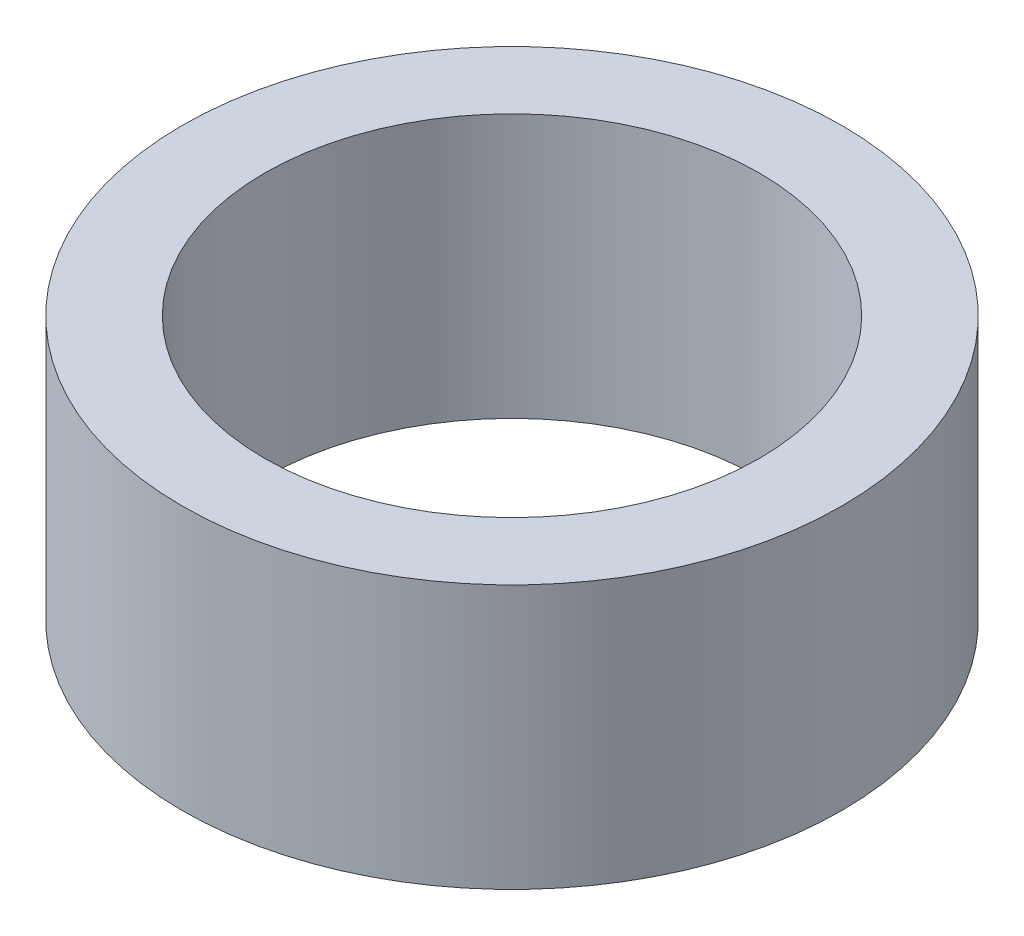
ISO-10303-21;
HEADER;
FILE_DESCRIPTION(('STEP AP214'),'2;1');
FILE_NAME('part.step','',(''),(''),'','','');
FILE_SCHEMA(('AUTOMOTIVE_DESIGN { 1 0 10303 214 1 1 1 1 }'));
ENDSEC;
DATA;
#1=APPLICATION_CONTEXT('core data for automotive mechanical design processes');
#2=APPLICATION_PROTOCOL_DEFINITION('international standard','automotive_design',2000,#1);
#3=PRODUCT_CONTEXT('',#1,'mechanical');
#4=PRODUCT('Part','Part','',(#3));
#5=PRODUCT_RELATED_PRODUCT_CATEGORY('part','',(#4));
#6=PRODUCT_DEFINITION_FORMATION('','',#4);
#7=PRODUCT_DEFINITION_CONTEXT('part definition',#1,'design');
#8=PRODUCT_DEFINITION('design','',#6,#7);
#9=PRODUCT_DEFINITION_SHAPE('','',#8);
#10=(LENGTH_UNIT() NAMED_UNIT(*) SI_UNIT(.MILLI.,.METRE.));
#11=(NAMED_UNIT(*) PLANE_ANGLE_UNIT() SI_UNIT($,.RADIAN.));
#12=(NAMED_UNIT(*) SI_UNIT($,.STERADIAN.) SOLID_ANGLE_UNIT());
#13=UNCERTAINTY_MEASURE_WITH_UNIT(LENGTH_MEASURE(1.E-05),#10,'distance_accuracy_value','');
#14=(GEOMETRIC_REPRESENTATION_CONTEXT(3) GLOBAL_UNCERTAINTY_ASSIGNED_CONTEXT((#13)) GLOBAL_UNIT_ASSIGNED_CONTEXT((#10,
#11,#12)) REPRESENTATION_CONTEXT('',''));
#15=CARTESIAN_POINT('',(0.,0.,0.));
#16=DIRECTION('',(0.,0.,1.));
#17=DIRECTION('',(1.,0.,0.));
#18=AXIS2_PLACEMENT_3D('',#15,#16,#17);
#19=CARTESIAN_POINT('',(0.,24.,0.));
#20=DIRECTION('',(0.,-1.,0.));
#21=DIRECTION('',(0.,0.,-1.));
#22=AXIS2_PLACEMENT_3D('',#19,#20,#21);
#23=CYLINDRICAL_SURFACE('',#22,30.);
#24=CARTESIAN_POINT('',(0.,24.,0.));
#25=DIRECTION('',(0.,1.,0.));
#26=DIRECTION('',(0.,0.,1.));
#27=AXIS2_PLACEMENT_3D('',#24,#25,#26);
#28=CIRCLE('',#27,30.);
#29=CARTESIAN_POINT('',(0.,24.,30.));
#30=VERTEX_POINT('',#29);
#31=EDGE_CURVE('E10',#30,#30,#28,.T.);
#32=ORIENTED_EDGE('',*,*,#31,.F.);
#33=EDGE_LOOP('',(#32));
#34=FACE_BOUND('',#33,.T.);
#35=CARTESIAN_POINT('',(0.,0.,0.));
#36=DIRECTION('',(0.,1.,0.));
#37=DIRECTION('',(0.,0.,1.));
#38=AXIS2_PLACEMENT_3D('',#35,#36,#37);
#39=CIRCLE('',#38,30.);
#40=CARTESIAN_POINT('',(0.,0.,30.));
#41=VERTEX_POINT('',#40);
#42=EDGE_CURVE('E37',#41,#41,#39,.T.);
#43=ORIENTED_EDGE('',*,*,#42,.T.);
#44=EDGE_LOOP('',(#43));
#45=FACE_BOUND('',#44,.T.);
#46=ADVANCED_FACE('F40',(#34,#45),#23,.T.);
#47=CARTESIAN_POINT('',(0.,24.,0.));
#48=DIRECTION('',(0.,1.,0.));
#49=DIRECTION('',(0.,0.,1.));
#50=AXIS2_PLACEMENT_3D('',#47,#48,#49);
#51=PLANE('',#50);
#52=CARTESIAN_POINT('',(0.,24.,0.));
#53=DIRECTION('',(0.,1.,0.));
#54=DIRECTION('',(0.,0.,1.));
#55=AXIS2_PLACEMENT_3D('',#52,#53,#54);
#56=CIRCLE('',#55,22.5);
#57=CARTESIAN_POINT('',(0.,24.,22.5));
#58=VERTEX_POINT('',#57);
#59=EDGE_CURVE('E50',#58,#58,#56,.T.);
#60=ORIENTED_EDGE('',*,*,#59,.F.);
#61=EDGE_LOOP('',(#60));
#62=FACE_BOUND('',#61,.T.);
#63=ORIENTED_EDGE('',*,*,#31,.T.);
#64=EDGE_LOOP('',(#63));
#65=FACE_BOUND('',#64,.T.);
#66=ADVANCED_FACE('F59',(#62,#65),#51,.T.);
#67=CARTESIAN_POINT('',(0.,0.,0.));
#68=DIRECTION('',(0.,1.,0.));
#69=DIRECTION('',(0.,0.,1.));
#70=AXIS2_PLACEMENT_3D('',#67,#68,#69);
#71=PLANE('',#70);
#72=CARTESIAN_POINT('',(0.,0.,0.));
#73=DIRECTION('',(0.,1.,0.));
#74=DIRECTION('',(0.,0.,1.));
#75=AXIS2_PLACEMENT_3D('',#72,#73,#74);
#76=CIRCLE('',#75,22.5);
#77=CARTESIAN_POINT('',(0.,0.,22.5));
#78=VERTEX_POINT('',#77);
#79=EDGE_CURVE('E47',#78,#78,#76,.T.);
#80=ORIENTED_EDGE('',*,*,#79,.T.);
#81=EDGE_LOOP('',(#80));
#82=FACE_BOUND('',#81,.T.);
#83=ORIENTED_EDGE('',*,*,#42,.F.);
#84=EDGE_LOOP('',(#83));
#85=FACE_BOUND('',#84,.T.);
#86=ADVANCED_FACE('F58',(#82,#85),#71,.F.);
#87=CARTESIAN_POINT('',(0.,24.,0.));
#88=DIRECTION('',(0.,-1.,0.));
#89=DIRECTION('',(0.,0.,-1.));
#90=AXIS2_PLACEMENT_3D('',#87,#88,#89);
#91=CYLINDRICAL_SURFACE('',#90,22.5);
#92=ORIENTED_EDGE('',*,*,#59,.T.);
#93=EDGE_LOOP('',(#92));
#94=FACE_BOUND('',#93,.T.);
#95=ORIENTED_EDGE('',*,*,#79,.F.);
#96=EDGE_LOOP('',(#95));
#97=FACE_BOUND('',#96,.T.);
#98=ADVANCED_FACE('F54',(#94,#97),#91,.F.);
#99=CLOSED_SHELL('',(#46,#66,#86,#98));
#100=MANIFOLD_SOLID_BREP('B2',#99);
#101=ADVANCED_BREP_SHAPE_REPRESENTATION('',(#18,#100),#14);
#102=SHAPE_DEFINITION_REPRESENTATION(#9,#101);
ENDSEC;
END-ISO-10303-21;
